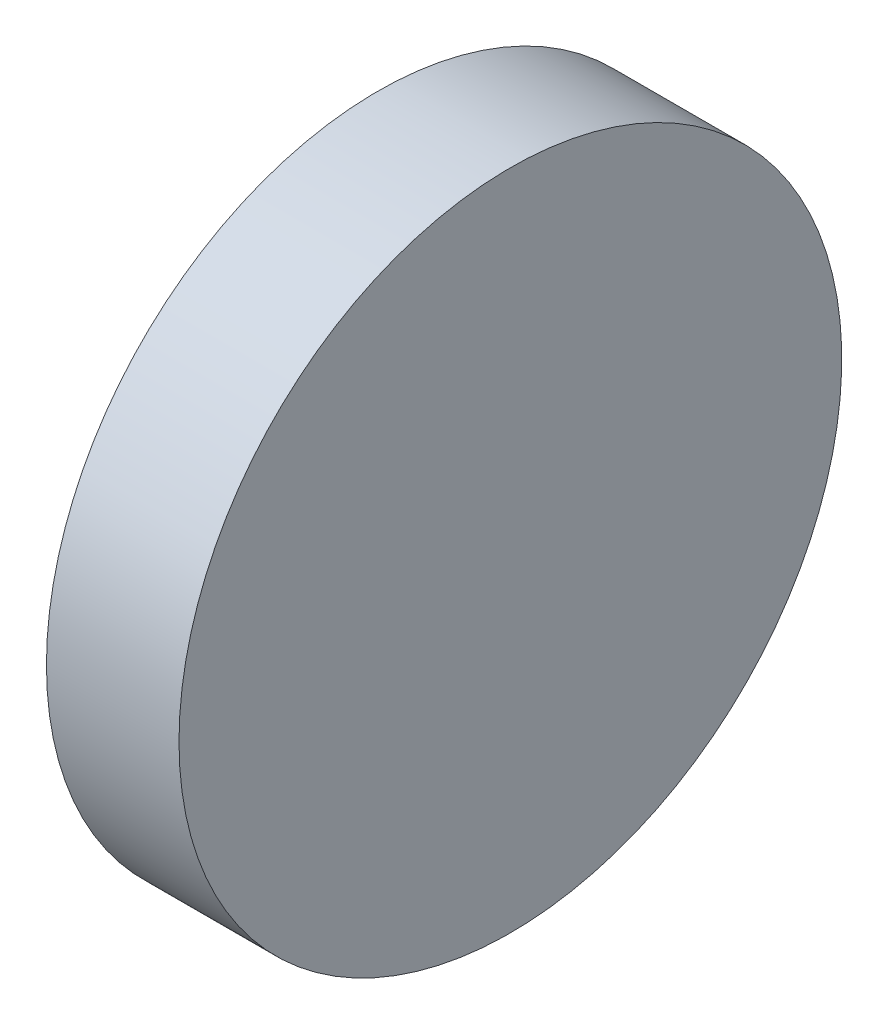
ISO-10303-21;
HEADER;
FILE_DESCRIPTION(('STEP AP214'),'2;1');
FILE_NAME('part.step','',(''),(''),'','','');
FILE_SCHEMA(('AUTOMOTIVE_DESIGN { 1 0 10303 214 1 1 1 1 }'));
ENDSEC;
DATA;
#1=APPLICATION_CONTEXT('core data for automotive mechanical design processes');
#2=APPLICATION_PROTOCOL_DEFINITION('international standard','automotive_design',2000,#1);
#3=PRODUCT_CONTEXT('',#1,'mechanical');
#4=PRODUCT('Part','Part','',(#3));
#5=PRODUCT_RELATED_PRODUCT_CATEGORY('part','',(#4));
#6=PRODUCT_DEFINITION_FORMATION('','',#4);
#7=PRODUCT_DEFINITION_CONTEXT('part definition',#1,'design');
#8=PRODUCT_DEFINITION('design','',#6,#7);
#9=PRODUCT_DEFINITION_SHAPE('','',#8);
#10=(LENGTH_UNIT() NAMED_UNIT(*) SI_UNIT(.MILLI.,.METRE.));
#11=(NAMED_UNIT(*) PLANE_ANGLE_UNIT() SI_UNIT($,.RADIAN.));
#12=(NAMED_UNIT(*) SI_UNIT($,.STERADIAN.) SOLID_ANGLE_UNIT());
#13=UNCERTAINTY_MEASURE_WITH_UNIT(LENGTH_MEASURE(1.E-05),#10,'distance_accuracy_value','');
#14=(GEOMETRIC_REPRESENTATION_CONTEXT(3) GLOBAL_UNCERTAINTY_ASSIGNED_CONTEXT((#13)) GLOBAL_UNIT_ASSIGNED_CONTEXT((#10,
#11,#12)) REPRESENTATION_CONTEXT('',''));
#15=CARTESIAN_POINT('',(0.,0.,0.));
#16=DIRECTION('',(0.,0.,1.));
#17=DIRECTION('',(1.,0.,0.));
#18=AXIS2_PLACEMENT_3D('',#15,#16,#17);
#19=CARTESIAN_POINT('',(530.314280985122,154.586358698031,0.));
#20=DIRECTION('',(-1.,0.,0.));
#21=DIRECTION('',(0.,0.,1.));
#22=AXIS2_PLACEMENT_3D('',#19,#20,#21);
#23=PLANE('',#22);
#24=CARTESIAN_POINT('',(530.314280985122,154.586358698031,0.));
#25=DIRECTION('',(-1.,0.,0.));
#26=DIRECTION('',(0.,0.,1.));
#27=AXIS2_PLACEMENT_3D('',#24,#25,#26);
#28=CIRCLE('',#27,25.);
#29=CARTESIAN_POINT('',(530.314280985122,154.586358698031,25.));
#30=VERTEX_POINT('',#29);
#31=EDGE_CURVE('E10',#30,#30,#28,.T.);
#32=ORIENTED_EDGE('',*,*,#31,.F.);
#33=EDGE_LOOP('',(#32));
#34=FACE_BOUND('',#33,.T.);
#35=ADVANCED_FACE('F35',(#34),#23,.F.);
#36=CARTESIAN_POINT('',(508.001603985232,154.586358698031,0.));
#37=DIRECTION('',(-1.,0.,0.));
#38=DIRECTION('',(0.,0.,1.));
#39=AXIS2_PLACEMENT_3D('',#36,#37,#38);
#40=CYLINDRICAL_SURFACE('',#39,25.);
#41=CARTESIAN_POINT('',(520.314280985122,154.586358698031,0.));
#42=DIRECTION('',(-1.,0.,0.));
#43=DIRECTION('',(0.,0.,1.));
#44=AXIS2_PLACEMENT_3D('',#41,#42,#43);
#45=CIRCLE('',#44,25.);
#46=CARTESIAN_POINT('',(520.314280985122,154.586358698031,25.));
#47=VERTEX_POINT('',#46);
#48=EDGE_CURVE('E41',#47,#47,#45,.T.);
#49=ORIENTED_EDGE('',*,*,#48,.F.);
#50=EDGE_LOOP('',(#49));
#51=FACE_BOUND('',#50,.T.);
#52=ORIENTED_EDGE('',*,*,#31,.T.);
#53=EDGE_LOOP('',(#52));
#54=FACE_BOUND('',#53,.T.);
#55=ADVANCED_FACE('F49',(#51,#54),#40,.T.);
#56=CARTESIAN_POINT('',(520.314280985122,154.586358698031,0.));
#57=DIRECTION('',(1.,0.,0.));
#58=DIRECTION('',(0.,0.,-1.));
#59=AXIS2_PLACEMENT_3D('',#56,#57,#58);
#60=PLANE('',#59);
#61=ORIENTED_EDGE('',*,*,#48,.T.);
#62=EDGE_LOOP('',(#61));
#63=FACE_BOUND('',#62,.T.);
#64=ADVANCED_FACE('F47',(#63),#60,.F.);
#65=CLOSED_SHELL('',(#35,#55,#64));
#66=MANIFOLD_SOLID_BREP('B2',#65);
#67=ADVANCED_BREP_SHAPE_REPRESENTATION('',(#18,#66),#14);
#68=SHAPE_DEFINITION_REPRESENTATION(#9,#67);
ENDSEC;
END-ISO-10303-21;
